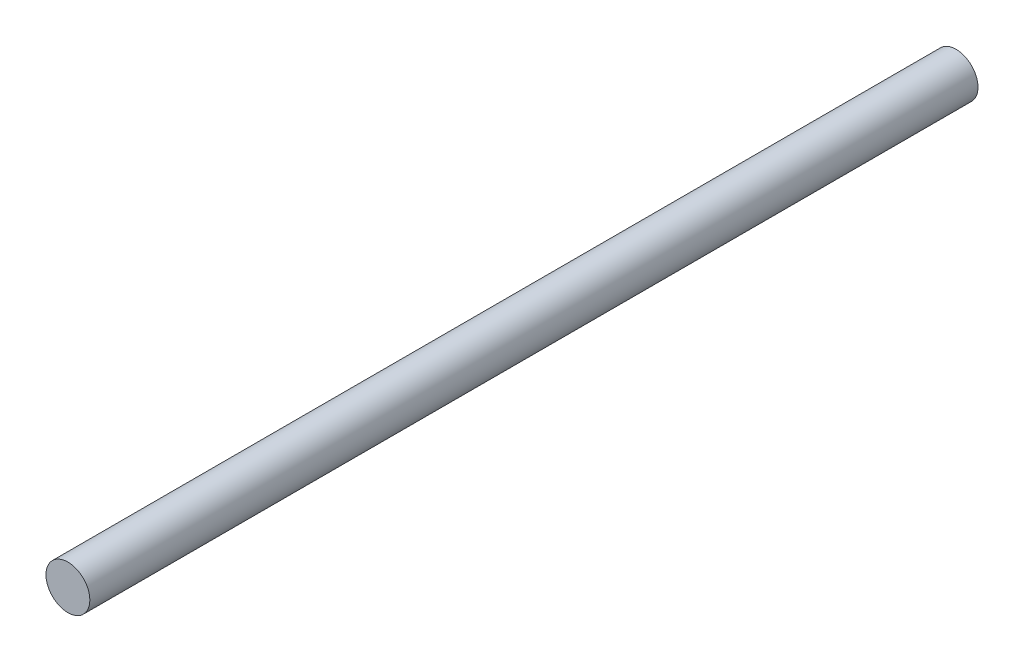
ISO-10303-21;
HEADER;
FILE_DESCRIPTION(('STEP AP214'),'2;1');
FILE_NAME('part.step','',(''),(''),'','','');
FILE_SCHEMA(('AUTOMOTIVE_DESIGN { 1 0 10303 214 1 1 1 1 }'));
ENDSEC;
DATA;
#1=APPLICATION_CONTEXT('core data for automotive mechanical design processes');
#2=APPLICATION_PROTOCOL_DEFINITION('international standard','automotive_design',2000,#1);
#3=PRODUCT_CONTEXT('',#1,'mechanical');
#4=PRODUCT('Part','Part','',(#3));
#5=PRODUCT_RELATED_PRODUCT_CATEGORY('part','',(#4));
#6=PRODUCT_DEFINITION_FORMATION('','',#4);
#7=PRODUCT_DEFINITION_CONTEXT('part definition',#1,'design');
#8=PRODUCT_DEFINITION('design','',#6,#7);
#9=PRODUCT_DEFINITION_SHAPE('','',#8);
#10=(LENGTH_UNIT() NAMED_UNIT(*) SI_UNIT(.MILLI.,.METRE.));
#11=(NAMED_UNIT(*) PLANE_ANGLE_UNIT() SI_UNIT($,.RADIAN.));
#12=(NAMED_UNIT(*) SI_UNIT($,.STERADIAN.) SOLID_ANGLE_UNIT());
#13=UNCERTAINTY_MEASURE_WITH_UNIT(LENGTH_MEASURE(1.E-05),#10,'distance_accuracy_value','');
#14=(GEOMETRIC_REPRESENTATION_CONTEXT(3) GLOBAL_UNCERTAINTY_ASSIGNED_CONTEXT((#13)) GLOBAL_UNIT_ASSIGNED_CONTEXT((#10,
#11,#12)) REPRESENTATION_CONTEXT('',''));
#15=CARTESIAN_POINT('',(0.,0.,0.));
#16=DIRECTION('',(0.,0.,1.));
#17=DIRECTION('',(1.,0.,0.));
#18=AXIS2_PLACEMENT_3D('',#15,#16,#17);
#19=CARTESIAN_POINT('',(0.,0.,450.));
#20=DIRECTION('',(0.,0.,-1.));
#21=DIRECTION('',(-1.,0.,0.));
#22=AXIS2_PLACEMENT_3D('',#19,#20,#21);
#23=CYLINDRICAL_SURFACE('',#22,11.1125);
#24=CARTESIAN_POINT('',(0.,0.,450.));
#25=DIRECTION('',(0.,0.,1.));
#26=DIRECTION('',(1.,0.,0.));
#27=AXIS2_PLACEMENT_3D('',#24,#25,#26);
#28=CIRCLE('',#27,11.1125);
#29=CARTESIAN_POINT('',(11.1125,0.,450.));
#30=VERTEX_POINT('',#29);
#31=EDGE_CURVE('E10',#30,#30,#28,.T.);
#32=ORIENTED_EDGE('',*,*,#31,.F.);
#33=EDGE_LOOP('',(#32));
#34=FACE_BOUND('',#33,.T.);
#35=CARTESIAN_POINT('',(0.,0.,0.));
#36=DIRECTION('',(0.,0.,1.));
#37=DIRECTION('',(1.,0.,0.));
#38=AXIS2_PLACEMENT_3D('',#35,#36,#37);
#39=CIRCLE('',#38,11.1125);
#40=CARTESIAN_POINT('',(11.1125,0.,0.));
#41=VERTEX_POINT('',#40);
#42=EDGE_CURVE('E34',#41,#41,#39,.T.);
#43=ORIENTED_EDGE('',*,*,#42,.T.);
#44=EDGE_LOOP('',(#43));
#45=FACE_BOUND('',#44,.T.);
#46=ADVANCED_FACE('F31',(#34,#45),#23,.T.);
#47=CARTESIAN_POINT('',(0.,0.,450.));
#48=DIRECTION('',(0.,0.,1.));
#49=DIRECTION('',(1.,0.,0.));
#50=AXIS2_PLACEMENT_3D('',#47,#48,#49);
#51=PLANE('',#50);
#52=ORIENTED_EDGE('',*,*,#31,.T.);
#53=EDGE_LOOP('',(#52));
#54=FACE_BOUND('',#53,.T.);
#55=ADVANCED_FACE('F46',(#54),#51,.T.);
#56=CARTESIAN_POINT('',(0.,0.,0.));
#57=DIRECTION('',(0.,0.,1.));
#58=DIRECTION('',(1.,0.,0.));
#59=AXIS2_PLACEMENT_3D('',#56,#57,#58);
#60=PLANE('',#59);
#61=ORIENTED_EDGE('',*,*,#42,.F.);
#62=EDGE_LOOP('',(#61));
#63=FACE_BOUND('',#62,.T.);
#64=ADVANCED_FACE('F44',(#63),#60,.F.);
#65=CLOSED_SHELL('',(#46,#55,#64));
#66=MANIFOLD_SOLID_BREP('B2',#65);
#67=ADVANCED_BREP_SHAPE_REPRESENTATION('',(#18,#66),#14);
#68=SHAPE_DEFINITION_REPRESENTATION(#9,#67);
ENDSEC;
END-ISO-10303-21;
